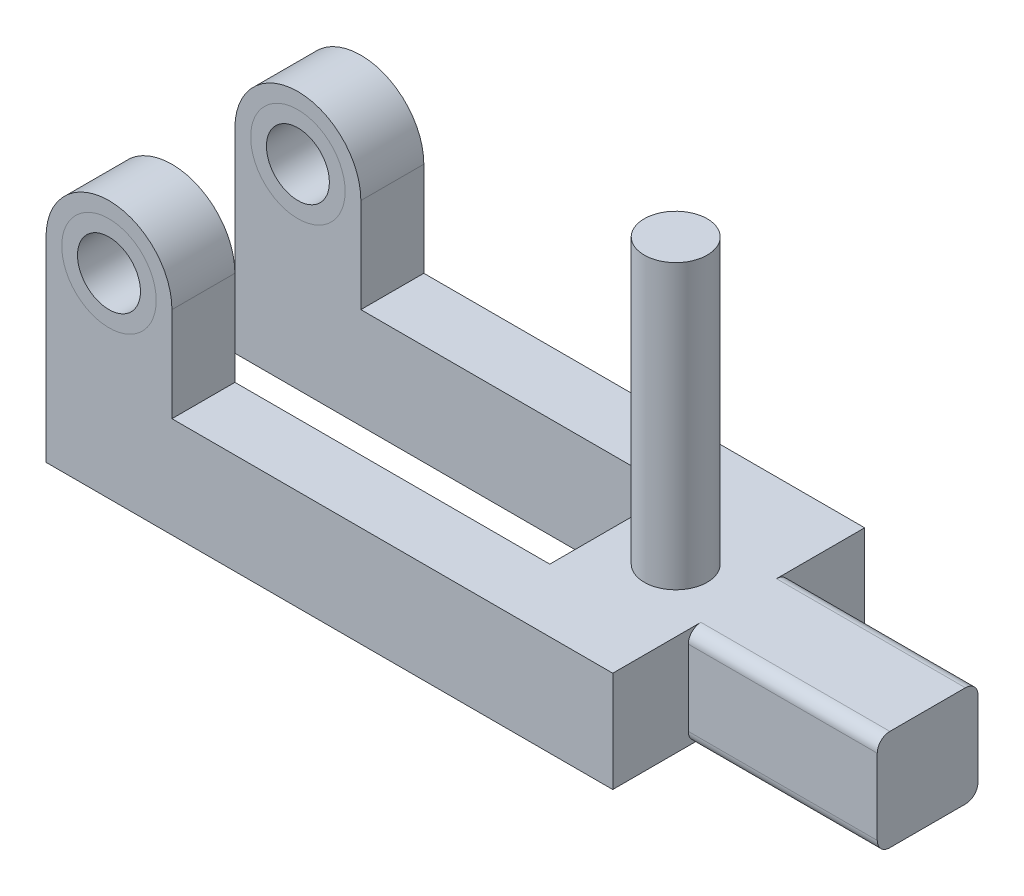
ISO-10303-21;
HEADER;
FILE_DESCRIPTION(('STEP AP214'),'2;1');
FILE_NAME('part.step','',(''),(''),'','','');
FILE_SCHEMA(('AUTOMOTIVE_DESIGN { 1 0 10303 214 1 1 1 1 }'));
ENDSEC;
DATA;
#1=APPLICATION_CONTEXT('core data for automotive mechanical design processes');
#2=APPLICATION_PROTOCOL_DEFINITION('international standard','automotive_design',2000,#1);
#3=PRODUCT_CONTEXT('',#1,'mechanical');
#4=PRODUCT('Part','Part','',(#3));
#5=PRODUCT_RELATED_PRODUCT_CATEGORY('part','',(#4));
#6=PRODUCT_DEFINITION_FORMATION('','',#4);
#7=PRODUCT_DEFINITION_CONTEXT('part definition',#1,'design');
#8=PRODUCT_DEFINITION('design','',#6,#7);
#9=PRODUCT_DEFINITION_SHAPE('','',#8);
#10=(LENGTH_UNIT() NAMED_UNIT(*) SI_UNIT(.MILLI.,.METRE.));
#11=(NAMED_UNIT(*) PLANE_ANGLE_UNIT() SI_UNIT($,.RADIAN.));
#12=(NAMED_UNIT(*) SI_UNIT($,.STERADIAN.) SOLID_ANGLE_UNIT());
#13=UNCERTAINTY_MEASURE_WITH_UNIT(LENGTH_MEASURE(1.E-05),#10,'distance_accuracy_value','');
#14=(GEOMETRIC_REPRESENTATION_CONTEXT(3) GLOBAL_UNCERTAINTY_ASSIGNED_CONTEXT((#13)) GLOBAL_UNIT_ASSIGNED_CONTEXT((#10,
#11,#12)) REPRESENTATION_CONTEXT('',''));
#15=CARTESIAN_POINT('',(0.,0.,0.));
#16=DIRECTION('',(0.,0.,1.));
#17=DIRECTION('',(1.,0.,0.));
#18=AXIS2_PLACEMENT_3D('',#15,#16,#17);
#19=CARTESIAN_POINT('',(9.99999999999999,31.,-40.));
#20=DIRECTION('',(0.,0.,1.));
#21=DIRECTION('',(1.,0.,0.));
#22=AXIS2_PLACEMENT_3D('',#19,#20,#21);
#23=CYLINDRICAL_SURFACE('',#22,7.5);
#24=CARTESIAN_POINT('',(9.99999999999999,31.,-40.));
#25=DIRECTION('',(0.,0.,1.));
#26=DIRECTION('',(1.,0.,0.));
#27=AXIS2_PLACEMENT_3D('',#24,#25,#26);
#28=CIRCLE('',#27,7.5);
#29=CARTESIAN_POINT('',(17.5,31.,-40.));
#30=VERTEX_POINT('',#29);
#31=EDGE_CURVE('E11',#30,#30,#28,.T.);
#32=ORIENTED_EDGE('',*,*,#31,.T.);
#33=EDGE_LOOP('',(#32));
#34=FACE_BOUND('',#33,.T.);
#35=CARTESIAN_POINT('',(9.99999999999999,31.,-30.));
#36=DIRECTION('',(0.,0.,1.));
#37=DIRECTION('',(1.,0.,0.));
#38=AXIS2_PLACEMENT_3D('',#35,#36,#37);
#39=CIRCLE('',#38,7.5);
#40=CARTESIAN_POINT('',(17.5,31.,-30.));
#41=VERTEX_POINT('',#40);
#42=EDGE_CURVE('E48',#41,#41,#39,.T.);
#43=ORIENTED_EDGE('',*,*,#42,.F.);
#44=EDGE_LOOP('',(#43));
#45=FACE_BOUND('',#44,.T.);
#46=ADVANCED_FACE('F45',(#34,#45),#23,.T.);
#47=CARTESIAN_POINT('',(9.99999999999999,31.,-40.));
#48=DIRECTION('',(0.,0.,1.));
#49=DIRECTION('',(1.,0.,0.));
#50=AXIS2_PLACEMENT_3D('',#47,#48,#49);
#51=PLANE('',#50);
#52=CARTESIAN_POINT('',(9.99999999999999,31.,-40.));
#53=DIRECTION('',(0.,0.,1.));
#54=DIRECTION('',(1.,0.,0.));
#55=AXIS2_PLACEMENT_3D('',#52,#53,#54);
#56=CIRCLE('',#55,5.);
#57=CARTESIAN_POINT('',(15.,31.,-40.));
#58=VERTEX_POINT('',#57);
#59=EDGE_CURVE('E55',#58,#58,#56,.T.);
#60=ORIENTED_EDGE('',*,*,#59,.T.);
#61=EDGE_LOOP('',(#60));
#62=FACE_BOUND('',#61,.T.);
#63=ORIENTED_EDGE('',*,*,#31,.F.);
#64=EDGE_LOOP('',(#63));
#65=FACE_BOUND('',#64,.T.);
#66=ADVANCED_FACE('F63',(#62,#65),#51,.F.);
#67=CARTESIAN_POINT('',(9.99999999999999,31.,-30.));
#68=DIRECTION('',(0.,0.,1.));
#69=DIRECTION('',(1.,0.,0.));
#70=AXIS2_PLACEMENT_3D('',#67,#68,#69);
#71=PLANE('',#70);
#72=CARTESIAN_POINT('',(9.99999999999999,31.,-30.));
#73=DIRECTION('',(0.,0.,1.));
#74=DIRECTION('',(1.,0.,0.));
#75=AXIS2_PLACEMENT_3D('',#72,#73,#74);
#76=CIRCLE('',#75,5.);
#77=CARTESIAN_POINT('',(15.,31.,-30.));
#78=VERTEX_POINT('',#77);
#79=EDGE_CURVE('E57',#78,#78,#76,.T.);
#80=ORIENTED_EDGE('',*,*,#79,.F.);
#81=EDGE_LOOP('',(#80));
#82=FACE_BOUND('',#81,.T.);
#83=ORIENTED_EDGE('',*,*,#42,.T.);
#84=EDGE_LOOP('',(#83));
#85=FACE_BOUND('',#84,.T.);
#86=ADVANCED_FACE('F69',(#82,#85),#71,.T.);
#87=CARTESIAN_POINT('',(9.99999999999999,31.,-40.));
#88=DIRECTION('',(0.,0.,1.));
#89=DIRECTION('',(1.,0.,0.));
#90=AXIS2_PLACEMENT_3D('',#87,#88,#89);
#91=CYLINDRICAL_SURFACE('',#90,5.);
#92=ORIENTED_EDGE('',*,*,#59,.F.);
#93=EDGE_LOOP('',(#92));
#94=FACE_BOUND('',#93,.T.);
#95=ORIENTED_EDGE('',*,*,#79,.T.);
#96=EDGE_LOOP('',(#95));
#97=FACE_BOUND('',#96,.T.);
#98=ADVANCED_FACE('F66',(#94,#97),#91,.F.);
#99=CLOSED_SHELL('',(#46,#66,#86,#98));
#100=MANIFOLD_SOLID_BREP('B2',#99);
#101=CARTESIAN_POINT('',(9.99999999999999,31.,-10.));
#102=DIRECTION('',(0.,0.,1.));
#103=DIRECTION('',(1.,0.,0.));
#104=AXIS2_PLACEMENT_3D('',#101,#102,#103);
#105=CYLINDRICAL_SURFACE('',#104,7.5);
#106=CARTESIAN_POINT('',(9.99999999999999,31.,-10.));
#107=DIRECTION('',(0.,0.,1.));
#108=DIRECTION('',(1.,0.,0.));
#109=AXIS2_PLACEMENT_3D('',#106,#107,#108);
#110=CIRCLE('',#109,7.5);
#111=CARTESIAN_POINT('',(17.5,31.,-10.));
#112=VERTEX_POINT('',#111);
#113=EDGE_CURVE('E44',#112,#112,#110,.T.);
#114=ORIENTED_EDGE('',*,*,#113,.T.);
#115=EDGE_LOOP('',(#114));
#116=FACE_BOUND('',#115,.T.);
#117=CARTESIAN_POINT('',(9.99999999999999,31.,0.));
#118=DIRECTION('',(0.,0.,1.));
#119=DIRECTION('',(1.,0.,0.));
#120=AXIS2_PLACEMENT_3D('',#117,#118,#119);
#121=CIRCLE('',#120,7.5);
#122=CARTESIAN_POINT('',(17.5,31.,0.));
#123=VERTEX_POINT('',#122);
#124=EDGE_CURVE('E138',#123,#123,#121,.T.);
#125=ORIENTED_EDGE('',*,*,#124,.F.);
#126=EDGE_LOOP('',(#125));
#127=FACE_BOUND('',#126,.T.);
#128=ADVANCED_FACE('F135',(#116,#127),#105,.T.);
#129=CARTESIAN_POINT('',(9.99999999999999,31.,-10.));
#130=DIRECTION('',(0.,0.,1.));
#131=DIRECTION('',(1.,0.,0.));
#132=AXIS2_PLACEMENT_3D('',#129,#130,#131);
#133=PLANE('',#132);
#134=CARTESIAN_POINT('',(9.99999999999999,31.,-10.));
#135=DIRECTION('',(0.,0.,1.));
#136=DIRECTION('',(1.,0.,0.));
#137=AXIS2_PLACEMENT_3D('',#134,#135,#136);
#138=CIRCLE('',#137,5.);
#139=CARTESIAN_POINT('',(15.,31.,-10.));
#140=VERTEX_POINT('',#139);
#141=EDGE_CURVE('E145',#140,#140,#138,.T.);
#142=ORIENTED_EDGE('',*,*,#141,.T.);
#143=EDGE_LOOP('',(#142));
#144=FACE_BOUND('',#143,.T.);
#145=ORIENTED_EDGE('',*,*,#113,.F.);
#146=EDGE_LOOP('',(#145));
#147=FACE_BOUND('',#146,.T.);
#148=ADVANCED_FACE('F153',(#144,#147),#133,.F.);
#149=CARTESIAN_POINT('',(9.99999999999999,31.,0.));
#150=DIRECTION('',(0.,0.,1.));
#151=DIRECTION('',(1.,0.,0.));
#152=AXIS2_PLACEMENT_3D('',#149,#150,#151);
#153=PLANE('',#152);
#154=CARTESIAN_POINT('',(9.99999999999999,31.,0.));
#155=DIRECTION('',(0.,0.,1.));
#156=DIRECTION('',(1.,0.,0.));
#157=AXIS2_PLACEMENT_3D('',#154,#155,#156);
#158=CIRCLE('',#157,5.);
#159=CARTESIAN_POINT('',(15.,31.,0.));
#160=VERTEX_POINT('',#159);
#161=EDGE_CURVE('E147',#160,#160,#158,.T.);
#162=ORIENTED_EDGE('',*,*,#161,.F.);
#163=EDGE_LOOP('',(#162));
#164=FACE_BOUND('',#163,.T.);
#165=ORIENTED_EDGE('',*,*,#124,.T.);
#166=EDGE_LOOP('',(#165));
#167=FACE_BOUND('',#166,.T.);
#168=ADVANCED_FACE('F159',(#164,#167),#153,.T.);
#169=CARTESIAN_POINT('',(9.99999999999999,31.,-10.));
#170=DIRECTION('',(0.,0.,1.));
#171=DIRECTION('',(1.,0.,0.));
#172=AXIS2_PLACEMENT_3D('',#169,#170,#171);
#173=CYLINDRICAL_SURFACE('',#172,5.);
#174=ORIENTED_EDGE('',*,*,#141,.F.);
#175=EDGE_LOOP('',(#174));
#176=FACE_BOUND('',#175,.T.);
#177=ORIENTED_EDGE('',*,*,#161,.T.);
#178=EDGE_LOOP('',(#177));
#179=FACE_BOUND('',#178,.T.);
#180=ADVANCED_FACE('F156',(#176,#179),#173,.F.);
#181=CLOSED_SHELL('',(#128,#148,#168,#180));
#182=MANIFOLD_SOLID_BREP('B6',#181);
#183=CARTESIAN_POINT('',(0.,16.,0.));
#184=DIRECTION('',(1.,0.,0.));
#185=DIRECTION('',(0.,0.,-1.));
#186=AXIS2_PLACEMENT_3D('',#183,#184,#185);
#187=PLANE('',#186);
#188=DIRECTION('',(0.,0.,1.));
#189=VECTOR('',#188,1.);
#190=CARTESIAN_POINT('',(0.,0.,0.));
#191=LINE('',#190,#189);
#192=CARTESIAN_POINT('',(0.,0.,-10.));
#193=VERTEX_POINT('',#192);
#194=CARTESIAN_POINT('',(0.,0.,0.));
#195=VERTEX_POINT('',#194);
#196=EDGE_CURVE('E392',#193,#195,#191,.T.);
#197=ORIENTED_EDGE('',*,*,#196,.T.);
#198=DIRECTION('',(0.,-1.,0.));
#199=VECTOR('',#198,1.);
#200=CARTESIAN_POINT('',(0.,16.,0.));
#201=LINE('',#200,#199);
#202=CARTESIAN_POINT('',(0.,31.,0.));
#203=VERTEX_POINT('',#202);
#204=EDGE_CURVE('E463',#203,#195,#201,.T.);
#205=ORIENTED_EDGE('',*,*,#204,.F.);
#206=DIRECTION('',(0.,0.,1.));
#207=VECTOR('',#206,1.);
#208=CARTESIAN_POINT('',(0.,31.,-10.));
#209=LINE('',#208,#207);
#210=CARTESIAN_POINT('',(0.,31.,-10.));
#211=VERTEX_POINT('',#210);
#212=EDGE_CURVE('E389',#211,#203,#209,.T.);
#213=ORIENTED_EDGE('',*,*,#212,.F.);
#214=DIRECTION('',(0.,-1.,0.));
#215=VECTOR('',#214,1.);
#216=CARTESIAN_POINT('',(0.,16.,-10.));
#217=LINE('',#216,#215);
#218=EDGE_CURVE('E412',#211,#193,#217,.T.);
#219=ORIENTED_EDGE('',*,*,#218,.T.);
#220=EDGE_LOOP('',(#197,#205,#213,#219));
#221=FACE_BOUND('',#220,.T.);
#222=ADVANCED_FACE('F196',(#221),#187,.F.);
#223=CARTESIAN_POINT('',(0.,16.,0.));
#224=DIRECTION('',(0.,0.,-1.));
#225=DIRECTION('',(-1.,0.,0.));
#226=AXIS2_PLACEMENT_3D('',#223,#224,#225);
#227=PLANE('',#226);
#228=DIRECTION('',(1.,0.,0.));
#229=VECTOR('',#228,1.);
#230=CARTESIAN_POINT('',(0.,0.,0.));
#231=LINE('',#230,#229);
#232=CARTESIAN_POINT('',(90.,0.,0.));
#233=VERTEX_POINT('',#232);
#234=EDGE_CURVE('E415',#195,#233,#231,.T.);
#235=ORIENTED_EDGE('',*,*,#234,.T.);
#236=DIRECTION('',(0.,-1.,0.));
#237=VECTOR('',#236,1.);
#238=CARTESIAN_POINT('',(90.,16.,0.));
#239=LINE('',#238,#237);
#240=CARTESIAN_POINT('',(90.,16.,0.));
#241=VERTEX_POINT('',#240);
#242=EDGE_CURVE('E460',#241,#233,#239,.T.);
#243=ORIENTED_EDGE('',*,*,#242,.F.);
#244=DIRECTION('',(1.,0.,0.));
#245=VECTOR('',#244,1.);
#246=CARTESIAN_POINT('',(0.,16.,0.));
#247=LINE('',#246,#245);
#248=CARTESIAN_POINT('',(20.,16.,0.));
#249=VERTEX_POINT('',#248);
#250=EDGE_CURVE('E396',#249,#241,#247,.T.);
#251=ORIENTED_EDGE('',*,*,#250,.F.);
#252=DIRECTION('',(0.,1.,0.));
#253=VECTOR('',#252,1.);
#254=CARTESIAN_POINT('',(20.,16.,0.));
#255=LINE('',#254,#253);
#256=CARTESIAN_POINT('',(20.,31.,0.));
#257=VERTEX_POINT('',#256);
#258=EDGE_CURVE('E374',#249,#257,#255,.T.);
#259=ORIENTED_EDGE('',*,*,#258,.T.);
#260=CARTESIAN_POINT('',(9.99999999999999,31.,0.));
#261=DIRECTION('',(0.,0.,1.));
#262=DIRECTION('',(1.,0.,0.));
#263=AXIS2_PLACEMENT_3D('',#260,#261,#262);
#264=CIRCLE('',#263,9.99999999999999);
#265=EDGE_CURVE('E381',#257,#203,#264,.T.);
#266=ORIENTED_EDGE('',*,*,#265,.T.);
#267=ORIENTED_EDGE('',*,*,#204,.T.);
#268=EDGE_LOOP('',(#235,#243,#251,#259,#266,#267));
#269=FACE_BOUND('',#268,.T.);
#270=CARTESIAN_POINT('',(9.99999999999999,31.,0.));
#271=DIRECTION('',(0.,0.,1.));
#272=DIRECTION('',(1.,0.,0.));
#273=AXIS2_PLACEMENT_3D('',#270,#271,#272);
#274=CIRCLE('',#273,7.5);
#275=CARTESIAN_POINT('',(17.5,31.,0.));
#276=VERTEX_POINT('',#275);
#277=EDGE_CURVE('E370',#276,#276,#274,.T.);
#278=ORIENTED_EDGE('',*,*,#277,.F.);
#279=EDGE_LOOP('',(#278));
#280=FACE_BOUND('',#279,.T.);
#281=ADVANCED_FACE('F552',(#269,#280),#227,.F.);
#282=CARTESIAN_POINT('',(90.,16.,0.));
#283=DIRECTION('',(-1.,0.,0.));
#284=DIRECTION('',(0.,0.,1.));
#285=AXIS2_PLACEMENT_3D('',#282,#283,#284);
#286=PLANE('',#285);
#287=DIRECTION('',(0.,0.,-1.));
#288=VECTOR('',#287,1.);
#289=CARTESIAN_POINT('',(90.,0.,0.));
#290=LINE('',#289,#288);
#291=CARTESIAN_POINT('',(90.,0.,-14.));
#292=VERTEX_POINT('',#291);
#293=EDGE_CURVE('E417',#233,#292,#290,.T.);
#294=ORIENTED_EDGE('',*,*,#293,.T.);
#295=CARTESIAN_POINT('',(90.,2.,-14.));
#296=DIRECTION('',(-1.,0.,0.));
#297=DIRECTION('',(0.,0.,1.));
#298=AXIS2_PLACEMENT_3D('',#295,#296,#297);
#299=CIRCLE('',#298,2.);
#300=CARTESIAN_POINT('',(90.,2.,-12.));
#301=VERTEX_POINT('',#300);
#302=EDGE_CURVE('E498',#292,#301,#299,.T.);
#303=ORIENTED_EDGE('',*,*,#302,.T.);
#304=DIRECTION('',(0.,-1.,0.));
#305=VECTOR('',#304,1.);
#306=CARTESIAN_POINT('',(90.,16.,-12.));
#307=LINE('',#306,#305);
#308=CARTESIAN_POINT('',(90.,14.,-12.));
#309=VERTEX_POINT('',#308);
#310=EDGE_CURVE('E457',#309,#301,#307,.T.);
#311=ORIENTED_EDGE('',*,*,#310,.F.);
#312=CARTESIAN_POINT('',(90.,14.,-14.));
#313=DIRECTION('',(-1.,0.,0.));
#314=DIRECTION('',(0.,0.,1.));
#315=AXIS2_PLACEMENT_3D('',#312,#313,#314);
#316=CIRCLE('',#315,2.);
#317=CARTESIAN_POINT('',(90.,16.,-14.));
#318=VERTEX_POINT('',#317);
#319=EDGE_CURVE('E204',#309,#318,#316,.T.);
#320=ORIENTED_EDGE('',*,*,#319,.T.);
#321=DIRECTION('',(0.,0.,-1.));
#322=VECTOR('',#321,1.);
#323=CARTESIAN_POINT('',(90.,16.,0.));
#324=LINE('',#323,#322);
#325=EDGE_CURVE('E398',#241,#318,#324,.T.);
#326=ORIENTED_EDGE('',*,*,#325,.F.);
#327=ORIENTED_EDGE('',*,*,#242,.T.);
#328=EDGE_LOOP('',(#294,#303,#311,#320,#326,#327));
#329=FACE_BOUND('',#328,.T.);
#330=ADVANCED_FACE('F507',(#329),#286,.F.);
#331=CARTESIAN_POINT('',(90.,16.,-12.));
#332=DIRECTION('',(0.,0.,-1.));
#333=DIRECTION('',(-1.,0.,0.));
#334=AXIS2_PLACEMENT_3D('',#331,#332,#333);
#335=PLANE('',#334);
#336=ORIENTED_EDGE('',*,*,#310,.T.);
#337=DIRECTION('',(1.,0.,0.));
#338=VECTOR('',#337,1.);
#339=CARTESIAN_POINT('',(120.,2.,-12.));
#340=LINE('',#339,#338);
#341=CARTESIAN_POINT('',(120.,2.,-12.));
#342=VERTEX_POINT('',#341);
#343=EDGE_CURVE('E486',#301,#342,#340,.T.);
#344=ORIENTED_EDGE('',*,*,#343,.T.);
#345=DIRECTION('',(0.,-1.,0.));
#346=VECTOR('',#345,1.);
#347=CARTESIAN_POINT('',(120.,16.,-12.));
#348=LINE('',#347,#346);
#349=CARTESIAN_POINT('',(120.,14.,-12.));
#350=VERTEX_POINT('',#349);
#351=EDGE_CURVE('E454',#350,#342,#348,.T.);
#352=ORIENTED_EDGE('',*,*,#351,.F.);
#353=DIRECTION('',(1.,0.,0.));
#354=VECTOR('',#353,1.);
#355=CARTESIAN_POINT('',(90.,14.,-12.));
#356=LINE('',#355,#354);
#357=EDGE_CURVE('E484',#350,#309,#356,.F.);
#358=ORIENTED_EDGE('',*,*,#357,.T.);
#359=EDGE_LOOP('',(#336,#344,#352,#358));
#360=FACE_BOUND('',#359,.T.);
#361=ADVANCED_FACE('F563',(#360),#335,.F.);
#362=CARTESIAN_POINT('',(120.,16.,-12.));
#363=DIRECTION('',(-1.,0.,0.));
#364=DIRECTION('',(0.,0.,1.));
#365=AXIS2_PLACEMENT_3D('',#362,#363,#364);
#366=PLANE('',#365);
#367=DIRECTION('',(0.,0.,-1.));
#368=VECTOR('',#367,1.);
#369=CARTESIAN_POINT('',(120.,0.,-12.));
#370=LINE('',#369,#368);
#371=CARTESIAN_POINT('',(120.,0.,-14.));
#372=VERTEX_POINT('',#371);
#373=CARTESIAN_POINT('',(120.,0.,-26.));
#374=VERTEX_POINT('',#373);
#375=EDGE_CURVE('E419',#372,#374,#370,.T.);
#376=ORIENTED_EDGE('',*,*,#375,.T.);
#377=CARTESIAN_POINT('',(120.,2.,-26.));
#378=DIRECTION('',(-1.,0.,0.));
#379=DIRECTION('',(0.,0.,1.));
#380=AXIS2_PLACEMENT_3D('',#377,#378,#379);
#381=CIRCLE('',#380,2.);
#382=CARTESIAN_POINT('',(120.,2.,-28.));
#383=VERTEX_POINT('',#382);
#384=EDGE_CURVE('E482',#374,#383,#381,.F.);
#385=ORIENTED_EDGE('',*,*,#384,.T.);
#386=DIRECTION('',(0.,-1.,0.));
#387=VECTOR('',#386,1.);
#388=CARTESIAN_POINT('',(120.,16.,-28.));
#389=LINE('',#388,#387);
#390=CARTESIAN_POINT('',(120.,14.,-28.));
#391=VERTEX_POINT('',#390);
#392=EDGE_CURVE('E451',#391,#383,#389,.T.);
#393=ORIENTED_EDGE('',*,*,#392,.F.);
#394=CARTESIAN_POINT('',(120.,14.,-26.));
#395=DIRECTION('',(-1.,0.,0.));
#396=DIRECTION('',(0.,0.,1.));
#397=AXIS2_PLACEMENT_3D('',#394,#395,#396);
#398=CIRCLE('',#397,2.);
#399=CARTESIAN_POINT('',(120.,16.,-26.));
#400=VERTEX_POINT('',#399);
#401=EDGE_CURVE('E478',#391,#400,#398,.F.);
#402=ORIENTED_EDGE('',*,*,#401,.T.);
#403=DIRECTION('',(0.,0.,-1.));
#404=VECTOR('',#403,1.);
#405=CARTESIAN_POINT('',(120.,16.,-12.));
#406=LINE('',#405,#404);
#407=CARTESIAN_POINT('',(120.,16.,-14.));
#408=VERTEX_POINT('',#407);
#409=EDGE_CURVE('E401',#408,#400,#406,.T.);
#410=ORIENTED_EDGE('',*,*,#409,.F.);
#411=CARTESIAN_POINT('',(120.,14.,-14.));
#412=DIRECTION('',(-1.,0.,0.));
#413=DIRECTION('',(0.,0.,1.));
#414=AXIS2_PLACEMENT_3D('',#411,#412,#413);
#415=CIRCLE('',#414,2.);
#416=EDGE_CURVE('E476',#408,#350,#415,.F.);
#417=ORIENTED_EDGE('',*,*,#416,.T.);
#418=ORIENTED_EDGE('',*,*,#351,.T.);
#419=CARTESIAN_POINT('',(120.,2.,-14.));
#420=DIRECTION('',(-1.,0.,0.));
#421=DIRECTION('',(0.,0.,1.));
#422=AXIS2_PLACEMENT_3D('',#419,#420,#421);
#423=CIRCLE('',#422,2.);
#424=EDGE_CURVE('E480',#342,#372,#423,.F.);
#425=ORIENTED_EDGE('',*,*,#424,.T.);
#426=EDGE_LOOP('',(#376,#385,#393,#402,#410,#417,#418,#425));
#427=FACE_BOUND('',#426,.T.);
#428=ADVANCED_FACE('F514',(#427),#366,.F.);
#429=CARTESIAN_POINT('',(90.,16.,-28.));
#430=DIRECTION('',(0.,0.,1.));
#431=DIRECTION('',(1.,0.,0.));
#432=AXIS2_PLACEMENT_3D('',#429,#430,#431);
#433=PLANE('',#432);
#434=ORIENTED_EDGE('',*,*,#392,.T.);
#435=DIRECTION('',(-1.,0.,0.));
#436=VECTOR('',#435,1.);
#437=CARTESIAN_POINT('',(90.,2.,-28.));
#438=LINE('',#437,#436);
#439=CARTESIAN_POINT('',(90.,2.,-28.));
#440=VERTEX_POINT('',#439);
#441=EDGE_CURVE('E468',#383,#440,#438,.T.);
#442=ORIENTED_EDGE('',*,*,#441,.T.);
#443=DIRECTION('',(0.,-1.,0.));
#444=VECTOR('',#443,1.);
#445=CARTESIAN_POINT('',(90.,16.,-28.));
#446=LINE('',#445,#444);
#447=CARTESIAN_POINT('',(90.,14.,-28.));
#448=VERTEX_POINT('',#447);
#449=EDGE_CURVE('E448',#448,#440,#446,.T.);
#450=ORIENTED_EDGE('',*,*,#449,.F.);
#451=DIRECTION('',(-1.,0.,0.));
#452=VECTOR('',#451,1.);
#453=CARTESIAN_POINT('',(90.,14.,-28.));
#454=LINE('',#453,#452);
#455=EDGE_CURVE('E466',#448,#391,#454,.F.);
#456=ORIENTED_EDGE('',*,*,#455,.T.);
#457=EDGE_LOOP('',(#434,#442,#450,#456));
#458=FACE_BOUND('',#457,.T.);
#459=ADVANCED_FACE('F571',(#458),#433,.F.);
#460=CARTESIAN_POINT('',(90.,16.,-28.));
#461=DIRECTION('',(-1.,0.,0.));
#462=DIRECTION('',(0.,0.,1.));
#463=AXIS2_PLACEMENT_3D('',#460,#461,#462);
#464=PLANE('',#463);
#465=DIRECTION('',(0.,0.,-1.));
#466=VECTOR('',#465,1.);
#467=CARTESIAN_POINT('',(90.,0.,-28.));
#468=LINE('',#467,#466);
#469=CARTESIAN_POINT('',(90.,0.,-26.));
#470=VERTEX_POINT('',#469);
#471=CARTESIAN_POINT('',(90.,0.,-40.));
#472=VERTEX_POINT('',#471);
#473=EDGE_CURVE('E422',#470,#472,#468,.T.);
#474=ORIENTED_EDGE('',*,*,#473,.T.);
#475=DIRECTION('',(0.,-1.,0.));
#476=VECTOR('',#475,1.);
#477=CARTESIAN_POINT('',(90.,16.,-40.));
#478=LINE('',#477,#476);
#479=CARTESIAN_POINT('',(90.,16.,-40.));
#480=VERTEX_POINT('',#479);
#481=EDGE_CURVE('E445',#480,#472,#478,.T.);
#482=ORIENTED_EDGE('',*,*,#481,.F.);
#483=DIRECTION('',(0.,0.,-1.));
#484=VECTOR('',#483,1.);
#485=CARTESIAN_POINT('',(90.,16.,-28.));
#486=LINE('',#485,#484);
#487=CARTESIAN_POINT('',(90.,16.,-26.));
#488=VERTEX_POINT('',#487);
#489=EDGE_CURVE('E404',#488,#480,#486,.T.);
#490=ORIENTED_EDGE('',*,*,#489,.F.);
#491=CARTESIAN_POINT('',(90.,14.,-26.));
#492=DIRECTION('',(-1.,0.,0.));
#493=DIRECTION('',(0.,0.,1.));
#494=AXIS2_PLACEMENT_3D('',#491,#492,#493);
#495=CIRCLE('',#494,2.);
#496=EDGE_CURVE('E500',#488,#448,#495,.T.);
#497=ORIENTED_EDGE('',*,*,#496,.T.);
#498=ORIENTED_EDGE('',*,*,#449,.T.);
#499=CARTESIAN_POINT('',(90.,2.,-26.));
#500=DIRECTION('',(-1.,0.,0.));
#501=DIRECTION('',(0.,0.,1.));
#502=AXIS2_PLACEMENT_3D('',#499,#500,#501);
#503=CIRCLE('',#502,2.);
#504=EDGE_CURVE('E495',#440,#470,#503,.T.);
#505=ORIENTED_EDGE('',*,*,#504,.T.);
#506=EDGE_LOOP('',(#474,#482,#490,#497,#498,#505));
#507=FACE_BOUND('',#506,.T.);
#508=ADVANCED_FACE('F524',(#507),#464,.F.);
#509=CARTESIAN_POINT('',(0.,16.,-40.));
#510=DIRECTION('',(0.,0.,1.));
#511=DIRECTION('',(1.,0.,0.));
#512=AXIS2_PLACEMENT_3D('',#509,#510,#511);
#513=PLANE('',#512);
#514=DIRECTION('',(-1.,0.,0.));
#515=VECTOR('',#514,1.);
#516=CARTESIAN_POINT('',(0.,0.,-40.));
#517=LINE('',#516,#515);
#518=CARTESIAN_POINT('',(0.,0.,-40.));
#519=VERTEX_POINT('',#518);
#520=EDGE_CURVE('E424',#472,#519,#517,.T.);
#521=ORIENTED_EDGE('',*,*,#520,.T.);
#522=DIRECTION('',(0.,-1.,0.));
#523=VECTOR('',#522,1.);
#524=CARTESIAN_POINT('',(0.,16.,-40.));
#525=LINE('',#524,#523);
#526=CARTESIAN_POINT('',(0.,31.,-40.));
#527=VERTEX_POINT('',#526);
#528=EDGE_CURVE('E356',#527,#519,#525,.T.);
#529=ORIENTED_EDGE('',*,*,#528,.F.);
#530=CARTESIAN_POINT('',(9.99999999999999,31.,-40.));
#531=DIRECTION('',(0.,0.,1.));
#532=DIRECTION('',(1.,0.,0.));
#533=AXIS2_PLACEMENT_3D('',#530,#531,#532);
#534=CIRCLE('',#533,9.99999999999999);
#535=CARTESIAN_POINT('',(20.,31.,-40.));
#536=VERTEX_POINT('',#535);
#537=EDGE_CURVE('E339',#536,#527,#534,.T.);
#538=ORIENTED_EDGE('',*,*,#537,.F.);
#539=DIRECTION('',(0.,1.,0.));
#540=VECTOR('',#539,1.);
#541=CARTESIAN_POINT('',(20.,16.,-40.));
#542=LINE('',#541,#540);
#543=CARTESIAN_POINT('',(20.,16.,-40.));
#544=VERTEX_POINT('',#543);
#545=EDGE_CURVE('E349',#544,#536,#542,.T.);
#546=ORIENTED_EDGE('',*,*,#545,.F.);
#547=DIRECTION('',(-1.,0.,0.));
#548=VECTOR('',#547,1.);
#549=CARTESIAN_POINT('',(0.,16.,-40.));
#550=LINE('',#549,#548);
#551=EDGE_CURVE('E211',#480,#544,#550,.T.);
#552=ORIENTED_EDGE('',*,*,#551,.F.);
#553=ORIENTED_EDGE('',*,*,#481,.T.);
#554=EDGE_LOOP('',(#521,#529,#538,#546,#552,#553));
#555=FACE_BOUND('',#554,.T.);
#556=CARTESIAN_POINT('',(9.99999999999999,31.,-40.));
#557=DIRECTION('',(0.,0.,1.));
#558=DIRECTION('',(1.,0.,0.));
#559=AXIS2_PLACEMENT_3D('',#556,#557,#558);
#560=CIRCLE('',#559,7.5);
#561=CARTESIAN_POINT('',(17.5,31.,-40.));
#562=VERTEX_POINT('',#561);
#563=EDGE_CURVE('E364',#562,#562,#560,.T.);
#564=ORIENTED_EDGE('',*,*,#563,.T.);
#565=EDGE_LOOP('',(#564));
#566=FACE_BOUND('',#565,.T.);
#567=ADVANCED_FACE('F353',(#555,#566),#513,.F.);
#568=CARTESIAN_POINT('',(0.,16.,-30.));
#569=DIRECTION('',(1.,0.,0.));
#570=DIRECTION('',(0.,0.,-1.));
#571=AXIS2_PLACEMENT_3D('',#568,#569,#570);
#572=PLANE('',#571);
#573=DIRECTION('',(0.,0.,1.));
#574=VECTOR('',#573,1.);
#575=CARTESIAN_POINT('',(0.,0.,-30.));
#576=LINE('',#575,#574);
#577=CARTESIAN_POINT('',(0.,0.,-30.));
#578=VERTEX_POINT('',#577);
#579=EDGE_CURVE('E426',#519,#578,#576,.T.);
#580=ORIENTED_EDGE('',*,*,#579,.T.);
#581=DIRECTION('',(0.,-1.,0.));
#582=VECTOR('',#581,1.);
#583=CARTESIAN_POINT('',(0.,16.,-30.));
#584=LINE('',#583,#582);
#585=CARTESIAN_POINT('',(0.,31.,-30.));
#586=VERTEX_POINT('',#585);
#587=EDGE_CURVE('E441',#586,#578,#584,.T.);
#588=ORIENTED_EDGE('',*,*,#587,.F.);
#589=DIRECTION('',(0.,0.,1.));
#590=VECTOR('',#589,1.);
#591=CARTESIAN_POINT('',(0.,31.,-40.));
#592=LINE('',#591,#590);
#593=EDGE_CURVE('E345',#527,#586,#592,.T.);
#594=ORIENTED_EDGE('',*,*,#593,.F.);
#595=ORIENTED_EDGE('',*,*,#528,.T.);
#596=EDGE_LOOP('',(#580,#588,#594,#595));
#597=FACE_BOUND('',#596,.T.);
#598=ADVANCED_FACE('F532',(#597),#572,.F.);
#599=CARTESIAN_POINT('',(0.,16.,-30.));
#600=DIRECTION('',(0.,0.,-1.));
#601=DIRECTION('',(-1.,0.,0.));
#602=AXIS2_PLACEMENT_3D('',#599,#600,#601);
#603=PLANE('',#602);
#604=DIRECTION('',(1.,0.,0.));
#605=VECTOR('',#604,1.);
#606=CARTESIAN_POINT('',(0.,0.,-30.));
#607=LINE('',#606,#605);
#608=CARTESIAN_POINT('',(70.,0.,-30.));
#609=VERTEX_POINT('',#608);
#610=EDGE_CURVE('E428',#578,#609,#607,.T.);
#611=ORIENTED_EDGE('',*,*,#610,.T.);
#612=DIRECTION('',(0.,-1.,0.));
#613=VECTOR('',#612,1.);
#614=CARTESIAN_POINT('',(70.,16.,-30.));
#615=LINE('',#614,#613);
#616=CARTESIAN_POINT('',(70.,16.,-30.));
#617=VERTEX_POINT('',#616);
#618=EDGE_CURVE('E438',#617,#609,#615,.T.);
#619=ORIENTED_EDGE('',*,*,#618,.F.);
#620=DIRECTION('',(1.,0.,0.));
#621=VECTOR('',#620,1.);
#622=CARTESIAN_POINT('',(0.,16.,-30.));
#623=LINE('',#622,#621);
#624=CARTESIAN_POINT('',(20.,16.,-30.));
#625=VERTEX_POINT('',#624);
#626=EDGE_CURVE('E407',#625,#617,#623,.T.);
#627=ORIENTED_EDGE('',*,*,#626,.F.);
#628=DIRECTION('',(0.,1.,0.));
#629=VECTOR('',#628,1.);
#630=CARTESIAN_POINT('',(20.,16.,-30.));
#631=LINE('',#630,#629);
#632=CARTESIAN_POINT('',(20.,31.,-30.));
#633=VERTEX_POINT('',#632);
#634=EDGE_CURVE('E362',#625,#633,#631,.T.);
#635=ORIENTED_EDGE('',*,*,#634,.T.);
#636=CARTESIAN_POINT('',(9.99999999999999,31.,-30.));
#637=DIRECTION('',(0.,0.,1.));
#638=DIRECTION('',(1.,0.,0.));
#639=AXIS2_PLACEMENT_3D('',#636,#637,#638);
#640=CIRCLE('',#639,9.99999999999999);
#641=EDGE_CURVE('E341',#633,#586,#640,.T.);
#642=ORIENTED_EDGE('',*,*,#641,.T.);
#643=ORIENTED_EDGE('',*,*,#587,.T.);
#644=EDGE_LOOP('',(#611,#619,#627,#635,#642,#643));
#645=FACE_BOUND('',#644,.T.);
#646=CARTESIAN_POINT('',(9.99999999999999,31.,-30.));
#647=DIRECTION('',(0.,0.,1.));
#648=DIRECTION('',(1.,0.,0.));
#649=AXIS2_PLACEMENT_3D('',#646,#647,#648);
#650=CIRCLE('',#649,7.5);
#651=CARTESIAN_POINT('',(17.5,31.,-30.));
#652=VERTEX_POINT('',#651);
#653=EDGE_CURVE('E811',#652,#652,#650,.T.);
#654=ORIENTED_EDGE('',*,*,#653,.F.);
#655=EDGE_LOOP('',(#654));
#656=FACE_BOUND('',#655,.T.);
#657=ADVANCED_FACE('F534',(#645,#656),#603,.F.);
#658=CARTESIAN_POINT('',(70.,16.,-10.));
#659=DIRECTION('',(1.,0.,0.));
#660=DIRECTION('',(0.,0.,-1.));
#661=AXIS2_PLACEMENT_3D('',#658,#659,#660);
#662=PLANE('',#661);
#663=DIRECTION('',(0.,0.,1.));
#664=VECTOR('',#663,1.);
#665=CARTESIAN_POINT('',(70.,0.,-10.));
#666=LINE('',#665,#664);
#667=CARTESIAN_POINT('',(70.,0.,-10.));
#668=VERTEX_POINT('',#667);
#669=EDGE_CURVE('E430',#609,#668,#666,.T.);
#670=ORIENTED_EDGE('',*,*,#669,.T.);
#671=DIRECTION('',(0.,-1.,0.));
#672=VECTOR('',#671,1.);
#673=CARTESIAN_POINT('',(70.,16.,-10.));
#674=LINE('',#673,#672);
#675=CARTESIAN_POINT('',(70.,16.,-10.));
#676=VERTEX_POINT('',#675);
#677=EDGE_CURVE('E435',#676,#668,#674,.T.);
#678=ORIENTED_EDGE('',*,*,#677,.F.);
#679=DIRECTION('',(0.,0.,1.));
#680=VECTOR('',#679,1.);
#681=CARTESIAN_POINT('',(70.,16.,-10.));
#682=LINE('',#681,#680);
#683=EDGE_CURVE('E409',#617,#676,#682,.T.);
#684=ORIENTED_EDGE('',*,*,#683,.F.);
#685=ORIENTED_EDGE('',*,*,#618,.T.);
#686=EDGE_LOOP('',(#670,#678,#684,#685));
#687=FACE_BOUND('',#686,.T.);
#688=ADVANCED_FACE('F540',(#687),#662,.F.);
#689=CARTESIAN_POINT('',(0.,16.,-10.));
#690=DIRECTION('',(0.,0.,1.));
#691=DIRECTION('',(1.,0.,0.));
#692=AXIS2_PLACEMENT_3D('',#689,#690,#691);
#693=PLANE('',#692);
#694=DIRECTION('',(-1.,0.,0.));
#695=VECTOR('',#694,1.);
#696=CARTESIAN_POINT('',(0.,0.,-10.));
#697=LINE('',#696,#695);
#698=EDGE_CURVE('E399',#668,#193,#697,.T.);
#699=ORIENTED_EDGE('',*,*,#698,.T.);
#700=ORIENTED_EDGE('',*,*,#218,.F.);
#701=CARTESIAN_POINT('',(9.99999999999999,31.,-10.));
#702=DIRECTION('',(0.,0.,1.));
#703=DIRECTION('',(1.,0.,0.));
#704=AXIS2_PLACEMENT_3D('',#701,#702,#703);
#705=CIRCLE('',#704,9.99999999999999);
#706=CARTESIAN_POINT('',(20.,31.,-10.));
#707=VERTEX_POINT('',#706);
#708=EDGE_CURVE('E380',#707,#211,#705,.T.);
#709=ORIENTED_EDGE('',*,*,#708,.F.);
#710=DIRECTION('',(0.,1.,0.));
#711=VECTOR('',#710,1.);
#712=CARTESIAN_POINT('',(20.,16.,-10.));
#713=LINE('',#712,#711);
#714=CARTESIAN_POINT('',(20.,16.,-10.));
#715=VERTEX_POINT('',#714);
#716=EDGE_CURVE('E377',#715,#707,#713,.T.);
#717=ORIENTED_EDGE('',*,*,#716,.F.);
#718=DIRECTION('',(-1.,0.,0.));
#719=VECTOR('',#718,1.);
#720=CARTESIAN_POINT('',(0.,16.,-10.));
#721=LINE('',#720,#719);
#722=EDGE_CURVE('E218',#676,#715,#721,.T.);
#723=ORIENTED_EDGE('',*,*,#722,.F.);
#724=ORIENTED_EDGE('',*,*,#677,.T.);
#725=EDGE_LOOP('',(#699,#700,#709,#717,#723,#724));
#726=FACE_BOUND('',#725,.T.);
#727=CARTESIAN_POINT('',(9.99999999999999,31.,-10.));
#728=DIRECTION('',(0.,0.,1.));
#729=DIRECTION('',(1.,0.,0.));
#730=AXIS2_PLACEMENT_3D('',#727,#728,#729);
#731=CIRCLE('',#730,7.5);
#732=CARTESIAN_POINT('',(17.5,31.,-10.));
#733=VERTEX_POINT('',#732);
#734=EDGE_CURVE('E371',#733,#733,#731,.T.);
#735=ORIENTED_EDGE('',*,*,#734,.T.);
#736=EDGE_LOOP('',(#735));
#737=FACE_BOUND('',#736,.T.);
#738=ADVANCED_FACE('F544',(#726,#737),#693,.F.);
#739=CARTESIAN_POINT('',(0.,16.,0.));
#740=DIRECTION('',(0.,-1.,0.));
#741=DIRECTION('',(0.,0.,-1.));
#742=AXIS2_PLACEMENT_3D('',#739,#740,#741);
#743=PLANE('',#742);
#744=CARTESIAN_POINT('',(80.,16.,-20.));
#745=DIRECTION('',(0.,-1.,0.));
#746=DIRECTION('',(0.,0.,-1.));
#747=AXIS2_PLACEMENT_3D('',#744,#745,#746);
#748=CIRCLE('',#747,5.);
#749=CARTESIAN_POINT('',(80.,16.,-25.));
#750=VERTEX_POINT('',#749);
#751=EDGE_CURVE('E133',#750,#750,#748,.F.);
#752=ORIENTED_EDGE('',*,*,#751,.F.);
#753=EDGE_LOOP('',(#752));
#754=FACE_BOUND('',#753,.T.);
#755=ORIENTED_EDGE('',*,*,#551,.T.);
#756=DIRECTION('',(0.,0.,1.));
#757=VECTOR('',#756,1.);
#758=CARTESIAN_POINT('',(20.,16.,-40.));
#759=LINE('',#758,#757);
#760=EDGE_CURVE('E346',#544,#625,#759,.T.);
#761=ORIENTED_EDGE('',*,*,#760,.T.);
#762=ORIENTED_EDGE('',*,*,#626,.T.);
#763=ORIENTED_EDGE('',*,*,#683,.T.);
#764=ORIENTED_EDGE('',*,*,#722,.T.);
#765=DIRECTION('',(0.,0.,1.));
#766=VECTOR('',#765,1.);
#767=CARTESIAN_POINT('',(20.,16.,-10.));
#768=LINE('',#767,#766);
#769=EDGE_CURVE('E384',#715,#249,#768,.T.);
#770=ORIENTED_EDGE('',*,*,#769,.T.);
#771=ORIENTED_EDGE('',*,*,#250,.T.);
#772=ORIENTED_EDGE('',*,*,#325,.T.);
#773=DIRECTION('',(1.,0.,0.));
#774=VECTOR('',#773,1.);
#775=CARTESIAN_POINT('',(0.,16.,-14.));
#776=LINE('',#775,#774);
#777=EDGE_CURVE('E489',#318,#408,#776,.T.);
#778=ORIENTED_EDGE('',*,*,#777,.T.);
#779=ORIENTED_EDGE('',*,*,#409,.T.);
#780=DIRECTION('',(-1.,0.,0.));
#781=VECTOR('',#780,1.);
#782=CARTESIAN_POINT('',(0.,16.,-26.));
#783=LINE('',#782,#781);
#784=EDGE_CURVE('E492',#400,#488,#783,.T.);
#785=ORIENTED_EDGE('',*,*,#784,.T.);
#786=ORIENTED_EDGE('',*,*,#489,.T.);
#787=EDGE_LOOP('',(#755,#761,#762,#763,#764,#770,#771,#772,#778,#779,#785,#786));
#788=FACE_BOUND('',#787,.T.);
#789=ADVANCED_FACE('F511',(#754,#788),#743,.F.);
#790=CARTESIAN_POINT('',(0.,0.,0.));
#791=DIRECTION('',(0.,-1.,0.));
#792=DIRECTION('',(0.,0.,-1.));
#793=AXIS2_PLACEMENT_3D('',#790,#791,#792);
#794=PLANE('',#793);
#795=ORIENTED_EDGE('',*,*,#473,.F.);
#796=DIRECTION('',(-1.,0.,0.));
#797=VECTOR('',#796,1.);
#798=CARTESIAN_POINT('',(120.,0.,-26.));
#799=LINE('',#798,#797);
#800=EDGE_CURVE('E474',#470,#374,#799,.F.);
#801=ORIENTED_EDGE('',*,*,#800,.T.);
#802=ORIENTED_EDGE('',*,*,#375,.F.);
#803=DIRECTION('',(1.,0.,0.));
#804=VECTOR('',#803,1.);
#805=CARTESIAN_POINT('',(90.,0.,-14.));
#806=LINE('',#805,#804);
#807=EDGE_CURVE('E471',#372,#292,#806,.F.);
#808=ORIENTED_EDGE('',*,*,#807,.T.);
#809=ORIENTED_EDGE('',*,*,#293,.F.);
#810=ORIENTED_EDGE('',*,*,#234,.F.);
#811=ORIENTED_EDGE('',*,*,#196,.F.);
#812=ORIENTED_EDGE('',*,*,#698,.F.);
#813=ORIENTED_EDGE('',*,*,#669,.F.);
#814=ORIENTED_EDGE('',*,*,#610,.F.);
#815=ORIENTED_EDGE('',*,*,#579,.F.);
#816=ORIENTED_EDGE('',*,*,#520,.F.);
#817=EDGE_LOOP('',(#795,#801,#802,#808,#809,#810,#811,#812,#813,#814,#815,#816));
#818=FACE_BOUND('',#817,.T.);
#819=ADVANCED_FACE('F528',(#818),#794,.T.);
#820=CARTESIAN_POINT('',(90.,2.,-26.));
#821=DIRECTION('',(1.,0.,0.));
#822=DIRECTION('',(0.,0.,-1.));
#823=AXIS2_PLACEMENT_3D('',#820,#821,#822);
#824=CYLINDRICAL_SURFACE('',#823,2.);
#825=ORIENTED_EDGE('',*,*,#384,.F.);
#826=ORIENTED_EDGE('',*,*,#800,.F.);
#827=ORIENTED_EDGE('',*,*,#504,.F.);
#828=ORIENTED_EDGE('',*,*,#441,.F.);
#829=EDGE_LOOP('',(#825,#826,#827,#828));
#830=FACE_BOUND('',#829,.T.);
#831=ADVANCED_FACE('F568',(#830),#824,.T.);
#832=CARTESIAN_POINT('',(90.,2.,-14.));
#833=DIRECTION('',(-1.,0.,0.));
#834=DIRECTION('',(0.,0.,1.));
#835=AXIS2_PLACEMENT_3D('',#832,#833,#834);
#836=CYLINDRICAL_SURFACE('',#835,2.);
#837=ORIENTED_EDGE('',*,*,#302,.F.);
#838=ORIENTED_EDGE('',*,*,#807,.F.);
#839=ORIENTED_EDGE('',*,*,#424,.F.);
#840=ORIENTED_EDGE('',*,*,#343,.F.);
#841=EDGE_LOOP('',(#837,#838,#839,#840));
#842=FACE_BOUND('',#841,.T.);
#843=ADVANCED_FACE('F561',(#842),#836,.T.);
#844=CARTESIAN_POINT('',(0.,14.,-26.));
#845=DIRECTION('',(-1.,0.,0.));
#846=DIRECTION('',(0.,0.,1.));
#847=AXIS2_PLACEMENT_3D('',#844,#845,#846);
#848=CYLINDRICAL_SURFACE('',#847,2.);
#849=ORIENTED_EDGE('',*,*,#401,.F.);
#850=ORIENTED_EDGE('',*,*,#455,.F.);
#851=ORIENTED_EDGE('',*,*,#496,.F.);
#852=ORIENTED_EDGE('',*,*,#784,.F.);
#853=EDGE_LOOP('',(#849,#850,#851,#852));
#854=FACE_BOUND('',#853,.T.);
#855=ADVANCED_FACE('F520',(#854),#848,.T.);
#856=CARTESIAN_POINT('',(0.,14.,-14.));
#857=DIRECTION('',(1.,0.,0.));
#858=DIRECTION('',(0.,0.,-1.));
#859=AXIS2_PLACEMENT_3D('',#856,#857,#858);
#860=CYLINDRICAL_SURFACE('',#859,2.);
#861=ORIENTED_EDGE('',*,*,#319,.F.);
#862=ORIENTED_EDGE('',*,*,#357,.F.);
#863=ORIENTED_EDGE('',*,*,#416,.F.);
#864=ORIENTED_EDGE('',*,*,#777,.F.);
#865=EDGE_LOOP('',(#861,#862,#863,#864));
#866=FACE_BOUND('',#865,.T.);
#867=ADVANCED_FACE('F198',(#866),#860,.T.);
#868=CARTESIAN_POINT('',(9.99999999999999,31.,-10.));
#869=DIRECTION('',(0.,0.,1.));
#870=DIRECTION('',(1.,0.,0.));
#871=AXIS2_PLACEMENT_3D('',#868,#869,#870);
#872=CYLINDRICAL_SURFACE('',#871,9.99999999999999);
#873=ORIENTED_EDGE('',*,*,#265,.F.);
#874=DIRECTION('',(0.,0.,1.));
#875=VECTOR('',#874,1.);
#876=CARTESIAN_POINT('',(20.,31.,-10.));
#877=LINE('',#876,#875);
#878=EDGE_CURVE('E393',#707,#257,#877,.T.);
#879=ORIENTED_EDGE('',*,*,#878,.F.);
#880=ORIENTED_EDGE('',*,*,#708,.T.);
#881=ORIENTED_EDGE('',*,*,#212,.T.);
#882=EDGE_LOOP('',(#873,#879,#880,#881));
#883=FACE_BOUND('',#882,.T.);
#884=ADVANCED_FACE('F596',(#883),#872,.T.);
#885=CARTESIAN_POINT('',(20.,16.,-10.));
#886=DIRECTION('',(1.,0.,0.));
#887=DIRECTION('',(0.,1.,0.));
#888=AXIS2_PLACEMENT_3D('',#885,#886,#887);
#889=PLANE('',#888);
#890=ORIENTED_EDGE('',*,*,#258,.F.);
#891=ORIENTED_EDGE('',*,*,#769,.F.);
#892=ORIENTED_EDGE('',*,*,#716,.T.);
#893=ORIENTED_EDGE('',*,*,#878,.T.);
#894=EDGE_LOOP('',(#890,#891,#892,#893));
#895=FACE_BOUND('',#894,.T.);
#896=ADVANCED_FACE('F549',(#895),#889,.T.);
#897=CARTESIAN_POINT('',(9.99999999999999,31.,-10.));
#898=DIRECTION('',(0.,0.,1.));
#899=DIRECTION('',(1.,0.,0.));
#900=AXIS2_PLACEMENT_3D('',#897,#898,#899);
#901=CYLINDRICAL_SURFACE('',#900,7.5);
#902=ORIENTED_EDGE('',*,*,#734,.F.);
#903=EDGE_LOOP('',(#902));
#904=FACE_BOUND('',#903,.T.);
#905=ORIENTED_EDGE('',*,*,#277,.T.);
#906=EDGE_LOOP('',(#905));
#907=FACE_BOUND('',#906,.T.);
#908=ADVANCED_FACE('F605',(#904,#907),#901,.F.);
#909=CARTESIAN_POINT('',(80.,61.,-20.));
#910=DIRECTION('',(0.,-1.,0.));
#911=DIRECTION('',(0.,0.,-1.));
#912=AXIS2_PLACEMENT_3D('',#909,#910,#911);
#913=CYLINDRICAL_SURFACE('',#912,5.);
#914=CARTESIAN_POINT('',(80.,61.,-20.));
#915=DIRECTION('',(0.,1.,0.));
#916=DIRECTION('',(0.,0.,1.));
#917=AXIS2_PLACEMENT_3D('',#914,#915,#916);
#918=CIRCLE('',#917,5.);
#919=CARTESIAN_POINT('',(80.,61.,-25.));
#920=VERTEX_POINT('',#919);
#921=EDGE_CURVE('E366',#920,#920,#918,.T.);
#922=CARTESIAN_POINT('',(80.,61.,-25.));
#923=CARTESIAN_POINT('',(80.,60.53125,-25.));
#924=CARTESIAN_POINT('',(80.,60.0625,-25.));
#925=CARTESIAN_POINT('',(80.,59.125,-25.));
#926=CARTESIAN_POINT('',(80.,58.65625,-25.));
#927=CARTESIAN_POINT('',(80.,57.71875,-25.));
#928=CARTESIAN_POINT('',(80.,57.25,-25.));
#929=CARTESIAN_POINT('',(80.,56.3125,-25.));
#930=CARTESIAN_POINT('',(80.,55.84375,-25.));
#931=CARTESIAN_POINT('',(80.,54.90625,-25.));
#932=CARTESIAN_POINT('',(80.,54.4375,-25.));
#933=CARTESIAN_POINT('',(80.,53.5,-25.));
#934=CARTESIAN_POINT('',(80.,53.03125,-25.));
#935=CARTESIAN_POINT('',(80.,52.09375,-25.));
#936=CARTESIAN_POINT('',(80.,51.625,-25.));
#937=CARTESIAN_POINT('',(80.,50.6875,-25.));
#938=CARTESIAN_POINT('',(80.,50.21875,-25.));
#939=CARTESIAN_POINT('',(80.,49.28125,-25.));
#940=CARTESIAN_POINT('',(80.,48.8125,-25.));
#941=CARTESIAN_POINT('',(80.,47.875,-25.));
#942=CARTESIAN_POINT('',(80.,47.40625,-25.));
#943=CARTESIAN_POINT('',(80.,46.46875,-25.));
#944=CARTESIAN_POINT('',(80.,46.,-25.));
#945=CARTESIAN_POINT('',(80.,45.0625,-25.));
#946=CARTESIAN_POINT('',(80.,44.59375,-25.));
#947=CARTESIAN_POINT('',(80.,43.65625,-25.));
#948=CARTESIAN_POINT('',(80.,43.1875,-25.));
#949=CARTESIAN_POINT('',(80.,42.25,-25.));
#950=CARTESIAN_POINT('',(80.,41.78125,-25.));
#951=CARTESIAN_POINT('',(80.,40.84375,-25.));
#952=CARTESIAN_POINT('',(80.,40.375,-25.));
#953=CARTESIAN_POINT('',(80.,39.4375,-25.));
#954=CARTESIAN_POINT('',(80.,38.96875,-25.));
#955=CARTESIAN_POINT('',(80.,38.03125,-25.));
#956=CARTESIAN_POINT('',(80.,37.5625,-25.));
#957=CARTESIAN_POINT('',(80.,36.625,-25.));
#958=CARTESIAN_POINT('',(80.,36.15625,-25.));
#959=CARTESIAN_POINT('',(80.,35.21875,-25.));
#960=CARTESIAN_POINT('',(80.,34.75,-25.));
#961=CARTESIAN_POINT('',(80.,33.8125,-25.));
#962=CARTESIAN_POINT('',(80.,33.34375,-25.));
#963=CARTESIAN_POINT('',(80.,32.40625,-25.));
#964=CARTESIAN_POINT('',(80.,31.9375,-25.));
#965=CARTESIAN_POINT('',(80.,31.,-25.));
#966=CARTESIAN_POINT('',(80.,30.53125,-25.));
#967=CARTESIAN_POINT('',(80.,29.59375,-25.));
#968=CARTESIAN_POINT('',(80.,29.125,-25.));
#969=CARTESIAN_POINT('',(80.,28.1875,-25.));
#970=CARTESIAN_POINT('',(80.,27.71875,-25.));
#971=CARTESIAN_POINT('',(80.,26.78125,-25.));
#972=CARTESIAN_POINT('',(80.,26.3125,-25.));
#973=CARTESIAN_POINT('',(80.,25.375,-25.));
#974=CARTESIAN_POINT('',(80.,24.90625,-25.));
#975=CARTESIAN_POINT('',(80.,23.96875,-25.));
#976=CARTESIAN_POINT('',(80.,23.5,-25.));
#977=CARTESIAN_POINT('',(80.,22.5625,-25.));
#978=CARTESIAN_POINT('',(80.,22.09375,-25.));
#979=CARTESIAN_POINT('',(80.,21.15625,-25.));
#980=CARTESIAN_POINT('',(80.,20.6875,-25.));
#981=CARTESIAN_POINT('',(80.,19.75,-25.));
#982=CARTESIAN_POINT('',(80.,19.28125,-25.));
#983=CARTESIAN_POINT('',(80.,18.34375,-25.));
#984=CARTESIAN_POINT('',(80.,17.875,-25.));
#985=CARTESIAN_POINT('',(80.,16.9375,-25.));
#986=CARTESIAN_POINT('',(80.,16.46875,-25.));
#987=CARTESIAN_POINT('',(80.,16.,-25.));
#988=B_SPLINE_CURVE_WITH_KNOTS('',3,(#922,#923,#924,#925,#926,#927,#928,#929,#930,#931,#932,
#933,#934,#935,#936,#937,#938,#939,#940,#941,#942,#943,#944,#945,#946,#947,#948,#949,#950,#951,
#952,#953,#954,#955,#956,#957,#958,#959,#960,#961,#962,#963,#964,#965,#966,#967,#968,#969,#970,
#971,#972,#973,#974,#975,#976,#977,#978,#979,#980,#981,#982,#983,#984,#985,#986,#987),
.UNSPECIFIED.,.F.,.F.,(4,2,2,2,2,2,2,2,2,2,2,2,2,2,2,2,2,2,2,2,2,2,2,2,2,2,2,2,2,2,2,2,4),(0.,
1.40625,2.8125,4.21875,5.62500000000001,7.03125,8.4375,9.84375,11.25,12.65625,14.0625,15.46875,
16.875,18.28125,19.6875,21.09375,22.5,23.90625,25.3125,26.71875,28.125,29.53125,30.9375,
32.34375,33.75,35.15625,36.5625,37.96875,39.375,40.78125,42.1875,43.59375,45.),.UNSPECIFIED.);
#989=EDGE_CURVE('BSEAM757',#920,#750,#988,.T.);
#990=ORIENTED_EDGE('',*,*,#921,.F.);
#991=ORIENTED_EDGE('',*,*,#751,.T.);
#992=ORIENTED_EDGE('',*,*,#989,.T.);
#993=ORIENTED_EDGE('',*,*,#989,.F.);
#994=EDGE_LOOP('',(#990,#992,#991,#993));
#995=FACE_BOUND('',#994,.T.);
#996=ADVANCED_FACE('F757',(#995),#913,.T.);
#997=CARTESIAN_POINT('',(80.,61.,-20.));
#998=DIRECTION('',(0.,1.,0.));
#999=DIRECTION('',(0.,0.,1.));
#1000=AXIS2_PLACEMENT_3D('',#997,#998,#999);
#1001=PLANE('',#1000);
#1002=ORIENTED_EDGE('',*,*,#921,.T.);
#1003=EDGE_LOOP('',(#1002));
#1004=FACE_BOUND('',#1003,.T.);
#1005=ADVANCED_FACE('F764',(#1004),#1001,.T.);
#1006=CARTESIAN_POINT('',(9.99999999999999,31.,-40.));
#1007=DIRECTION('',(0.,0.,1.));
#1008=DIRECTION('',(1.,0.,0.));
#1009=AXIS2_PLACEMENT_3D('',#1006,#1007,#1008);
#1010=CYLINDRICAL_SURFACE('',#1009,9.99999999999999);
#1011=ORIENTED_EDGE('',*,*,#641,.F.);
#1012=DIRECTION('',(0.,0.,1.));
#1013=VECTOR('',#1012,1.);
#1014=CARTESIAN_POINT('',(20.,31.,-40.));
#1015=LINE('',#1014,#1013);
#1016=EDGE_CURVE('E334',#536,#633,#1015,.T.);
#1017=ORIENTED_EDGE('',*,*,#1016,.F.);
#1018=ORIENTED_EDGE('',*,*,#537,.T.);
#1019=ORIENTED_EDGE('',*,*,#593,.T.);
#1020=EDGE_LOOP('',(#1011,#1017,#1018,#1019));
#1021=FACE_BOUND('',#1020,.T.);
#1022=ADVANCED_FACE('F336',(#1021),#1010,.T.);
#1023=CARTESIAN_POINT('',(20.,16.,-40.));
#1024=DIRECTION('',(1.,0.,0.));
#1025=DIRECTION('',(0.,1.,0.));
#1026=AXIS2_PLACEMENT_3D('',#1023,#1024,#1025);
#1027=PLANE('',#1026);
#1028=ORIENTED_EDGE('',*,*,#634,.F.);
#1029=ORIENTED_EDGE('',*,*,#760,.F.);
#1030=ORIENTED_EDGE('',*,*,#545,.T.);
#1031=ORIENTED_EDGE('',*,*,#1016,.T.);
#1032=EDGE_LOOP('',(#1028,#1029,#1030,#1031));
#1033=FACE_BOUND('',#1032,.T.);
#1034=ADVANCED_FACE('F350',(#1033),#1027,.T.);
#1035=CARTESIAN_POINT('',(9.99999999999999,31.,-40.));
#1036=DIRECTION('',(0.,0.,1.));
#1037=DIRECTION('',(1.,0.,0.));
#1038=AXIS2_PLACEMENT_3D('',#1035,#1036,#1037);
#1039=CYLINDRICAL_SURFACE('',#1038,7.5);
#1040=ORIENTED_EDGE('',*,*,#563,.F.);
#1041=EDGE_LOOP('',(#1040));
#1042=FACE_BOUND('',#1041,.T.);
#1043=ORIENTED_EDGE('',*,*,#653,.T.);
#1044=EDGE_LOOP('',(#1043));
#1045=FACE_BOUND('',#1044,.T.);
#1046=ADVANCED_FACE('F787',(#1042,#1045),#1039,.F.);
#1047=CLOSED_SHELL('',(#222,#281,#330,#361,#428,#459,#508,#567,#598,#657,#688,#738,#789,#819,
#831,#843,#855,#867,#884,#896,#908,#996,#1005,#1022,#1034,#1046));
#1048=MANIFOLD_SOLID_BREP('B39',#1047);
#1049=ADVANCED_BREP_SHAPE_REPRESENTATION('',(#18,#100,#182,#1048),#14);
#1050=SHAPE_DEFINITION_REPRESENTATION(#9,#1049);
ENDSEC;
END-ISO-10303-21;
